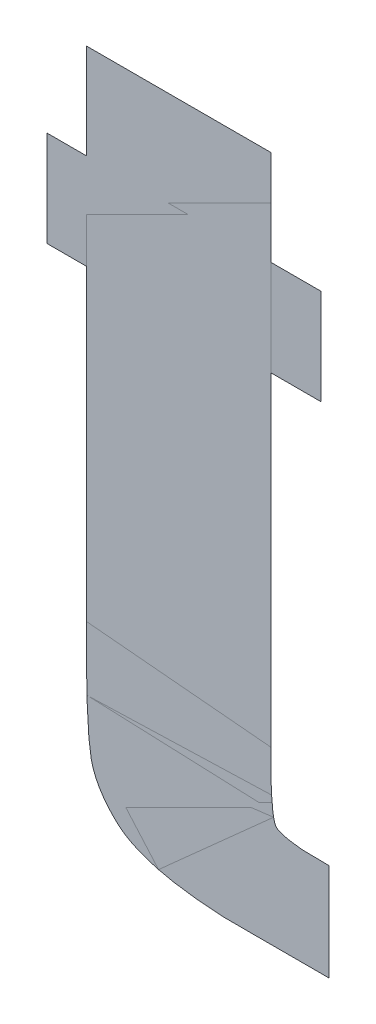
ISO-10303-21;
HEADER;
FILE_DESCRIPTION(('STEP AP214'),'2;1');
FILE_NAME('part.step','',(''),(''),'','','');
FILE_SCHEMA(('AUTOMOTIVE_DESIGN { 1 0 10303 214 1 1 1 1 }'));
ENDSEC;
DATA;
#1=APPLICATION_CONTEXT('core data for automotive mechanical design processes');
#2=APPLICATION_PROTOCOL_DEFINITION('international standard','automotive_design',2000,#1);
#3=PRODUCT_CONTEXT('',#1,'mechanical');
#4=PRODUCT('Part','Part','',(#3));
#5=PRODUCT_RELATED_PRODUCT_CATEGORY('part','',(#4));
#6=PRODUCT_DEFINITION_FORMATION('','',#4);
#7=PRODUCT_DEFINITION_CONTEXT('part definition',#1,'design');
#8=PRODUCT_DEFINITION('design','',#6,#7);
#9=PRODUCT_DEFINITION_SHAPE('','',#8);
#10=(LENGTH_UNIT() NAMED_UNIT(*) SI_UNIT(.MILLI.,.METRE.));
#11=(NAMED_UNIT(*) PLANE_ANGLE_UNIT() SI_UNIT($,.RADIAN.));
#12=(NAMED_UNIT(*) SI_UNIT($,.STERADIAN.) SOLID_ANGLE_UNIT());
#13=UNCERTAINTY_MEASURE_WITH_UNIT(LENGTH_MEASURE(1.E-05),#10,'distance_accuracy_value','');
#14=(GEOMETRIC_REPRESENTATION_CONTEXT(3) GLOBAL_UNCERTAINTY_ASSIGNED_CONTEXT((#13)) GLOBAL_UNIT_ASSIGNED_CONTEXT((#10,
#11,#12)) REPRESENTATION_CONTEXT('',''));
#15=CARTESIAN_POINT('',(0.,0.,0.));
#16=DIRECTION('',(0.,0.,1.));
#17=DIRECTION('',(1.,0.,0.));
#18=AXIS2_PLACEMENT_3D('',#15,#16,#17);
#19=CARTESIAN_POINT('',(6.196226826953,0.801967895412,0.001668));
#20=DIRECTION('',(0.,0.,1.));
#21=DIRECTION('',(1.,0.,0.));
#22=AXIS2_PLACEMENT_3D('',#19,#20,#21);
#23=PLANE('',#22);
#24=CARTESIAN_POINT('',(6.23493270751,0.840089908038,0.001668));
#25=DIRECTION('',(0.,1.,0.));
#26=VECTOR('',#25,1.);
#27=LINE('',#24,#26);
#28=CARTESIAN_POINT('',(6.23493270751,0.840089908038,0.0015));
#29=VERTEX_POINT('',#28);
#30=CARTESIAN_POINT('',(6.23493270751,0.869123819549,0.0015));
#31=VERTEX_POINT('',#30);
#32=EDGE_CURVE('E215',#29,#31,#27,.T.);
#33=ORIENTED_EDGE('',*,*,#32,.T.);
#34=CARTESIAN_POINT('',(6.23493270751,0.869123819549,0.001668));
#35=DIRECTION('',(-1.,0.,0.));
#36=VECTOR('',#35,1.);
#37=LINE('',#34,#36);
#38=CARTESIAN_POINT('',(6.219740544511,0.869123819549,0.0015));
#39=VERTEX_POINT('',#38);
#40=EDGE_CURVE('E28',#31,#39,#37,.T.);
#41=ORIENTED_EDGE('',*,*,#40,.T.);
#42=CARTESIAN_POINT('',(6.219740544511,0.869123819549,0.001668));
#43=DIRECTION('',(0.,1.,0.));
#44=VECTOR('',#43,1.);
#45=LINE('',#42,#44);
#46=CARTESIAN_POINT('',(6.219740544511,0.897988929248,0.0015));
#47=VERTEX_POINT('',#46);
#48=EDGE_CURVE('E11',#39,#47,#45,.T.);
#49=ORIENTED_EDGE('',*,*,#48,.T.);
#50=CARTESIAN_POINT('',(6.219740544511,0.897988929248,0.001668));
#51=DIRECTION('',(-1.,0.,0.));
#52=VECTOR('',#51,1.);
#53=LINE('',#50,#52);
#54=CARTESIAN_POINT('',(6.163698343224,0.897988929248,0.0015));
#55=VERTEX_POINT('',#54);
#56=EDGE_CURVE('E77',#47,#55,#53,.T.);
#57=ORIENTED_EDGE('',*,*,#56,.T.);
#58=CARTESIAN_POINT('',(6.163698343224,0.897988929248,0.001668));
#59=DIRECTION('',(0.,-1.,0.));
#60=VECTOR('',#59,1.);
#61=LINE('',#58,#60);
#62=CARTESIAN_POINT('',(6.163698343224,0.869123819549,0.0015));
#63=VERTEX_POINT('',#62);
#64=EDGE_CURVE('E74',#55,#63,#61,.T.);
#65=ORIENTED_EDGE('',*,*,#64,.T.);
#66=CARTESIAN_POINT('',(6.163698343224,0.869123819549,0.001668));
#67=DIRECTION('',(-1.,0.,0.));
#68=VECTOR('',#67,1.);
#69=LINE('',#66,#68);
#70=CARTESIAN_POINT('',(6.151713414635,0.869123819549,0.0015));
#71=VERTEX_POINT('',#70);
#72=EDGE_CURVE('E196',#63,#71,#69,.T.);
#73=ORIENTED_EDGE('',*,*,#72,.T.);
#74=CARTESIAN_POINT('',(6.151713414635,0.869123819549,0.001668));
#75=DIRECTION('',(0.,-1.,0.));
#76=VECTOR('',#75,1.);
#77=LINE('',#74,#76);
#78=CARTESIAN_POINT('',(6.151713414635,0.840089908038,0.0015));
#79=VERTEX_POINT('',#78);
#80=EDGE_CURVE('E197',#71,#79,#77,.T.);
#81=ORIENTED_EDGE('',*,*,#80,.T.);
#82=CARTESIAN_POINT('',(6.151713414635,0.840089908038,0.001668));
#83=DIRECTION('',(1.,0.,0.));
#84=VECTOR('',#83,1.);
#85=LINE('',#82,#84);
#86=CARTESIAN_POINT('',(6.163698343224,0.840089908038,0.0015));
#87=VERTEX_POINT('',#86);
#88=EDGE_CURVE('E198',#79,#87,#85,.T.);
#89=ORIENTED_EDGE('',*,*,#88,.T.);
#90=CARTESIAN_POINT('',(6.163698343224,0.840089908038,0.001668));
#91=DIRECTION('',(0.,-1.,0.));
#92=VECTOR('',#91,1.);
#93=LINE('',#90,#92);
#94=CARTESIAN_POINT('',(6.163698343224,0.746742506497,0.0015));
#95=VERTEX_POINT('',#94);
#96=EDGE_CURVE('E200',#87,#95,#93,.T.);
#97=ORIENTED_EDGE('',*,*,#96,.T.);
#98=CARTESIAN_POINT('',(6.163698343224,0.746742506497,0.001668));
#99=CARTESIAN_POINT('',(6.163698343224,0.720283110157466,0.001668));
#100=CARTESIAN_POINT('',(6.165217559524,0.7119693334085,0.001668));
#101=CARTESIAN_POINT('',(6.16649785844449,0.704963010874355,0.001668));
#102=CARTESIAN_POINT('',(6.1729824428345,0.6988027921425,0.001668));
#103=CARTESIAN_POINT('',(6.18240001561195,0.689856296154,0.001668));
#104=CARTESIAN_POINT('',(6.214676490178,0.689856296154,0.001668));
#105=B_SPLINE_CURVE_WITH_KNOTS('',2,(#98,#99,#100,#101,#102,#103,#104),.UNSPECIFIED.,.F.,.F.,(3,
2,2,3),(0.,0.25,0.5,1.),.UNSPECIFIED.);
#106=CARTESIAN_POINT('',(6.214676490178,0.689856296154,0.0015));
#107=VERTEX_POINT('',#106);
#108=EDGE_CURVE('E202',#95,#107,#105,.T.);
#109=ORIENTED_EDGE('',*,*,#108,.T.);
#110=CARTESIAN_POINT('',(6.214676490178,0.689856296154,0.001668));
#111=DIRECTION('',(1.,0.,0.));
#112=VECTOR('',#111,1.);
#113=LINE('',#110,#112);
#114=CARTESIAN_POINT('',(6.237295932866,0.689856296154,0.0015));
#115=VERTEX_POINT('',#114);
#116=EDGE_CURVE('E204',#107,#115,#113,.T.);
#117=ORIENTED_EDGE('',*,*,#116,.T.);
#118=CARTESIAN_POINT('',(6.237295932866,0.689856296154,0.001668));
#119=DIRECTION('',(0.,1.,0.));
#120=VECTOR('',#119,1.);
#121=LINE('',#118,#120);
#122=CARTESIAN_POINT('',(6.237295932866,0.719396613097,0.0015));
#123=VERTEX_POINT('',#122);
#124=EDGE_CURVE('E206',#115,#123,#121,.T.);
#125=ORIENTED_EDGE('',*,*,#124,.T.);
#126=CARTESIAN_POINT('',(6.237295932866,0.719396613097,0.001668));
#127=CARTESIAN_POINT('',(6.22458782101224,0.719396613097,0.001668));
#128=CARTESIAN_POINT('',(6.221597364433,0.721506635736,0.001668));
#129=CARTESIAN_POINT('',(6.219740544511,0.722816780848679,0.001668));
#130=CARTESIAN_POINT('',(6.219740544511,0.741678452163,0.001668));
#131=B_SPLINE_CURVE_WITH_KNOTS('',2,(#126,#127,#128,#129,#130),.UNSPECIFIED.,.F.,.F.,(3,2,3),
(0.,0.5,1.),.UNSPECIFIED.);
#132=CARTESIAN_POINT('',(6.219740544511,0.741678452163,0.0015));
#133=VERTEX_POINT('',#132);
#134=EDGE_CURVE('E208',#123,#133,#131,.T.);
#135=ORIENTED_EDGE('',*,*,#134,.T.);
#136=CARTESIAN_POINT('',(6.219740544511,0.741678452163,0.001668));
#137=DIRECTION('',(0.,1.,0.));
#138=VECTOR('',#137,1.);
#139=LINE('',#136,#138);
#140=CARTESIAN_POINT('',(6.219740544511,0.840089908038,0.0015));
#141=VERTEX_POINT('',#140);
#142=EDGE_CURVE('E210',#133,#141,#139,.T.);
#143=ORIENTED_EDGE('',*,*,#142,.T.);
#144=CARTESIAN_POINT('',(6.219740544511,0.840089908038,0.001668));
#145=DIRECTION('',(1.,0.,0.));
#146=VECTOR('',#145,1.);
#147=LINE('',#144,#146);
#148=EDGE_CURVE('E213',#141,#29,#147,.T.);
#149=ORIENTED_EDGE('',*,*,#148,.T.);
#150=EDGE_LOOP('',(#33,#41,#49,#57,#65,#73,#81,#89,#97,#109,#117,#125,#135,#143,#149));
#151=FACE_BOUND('',#150,.T.);
#152=ADVANCED_FACE('F17',(#151),#23,.T.);
#153=CARTESIAN_POINT('',(6.196226826953,0.801967895412,0.001332));
#154=DIRECTION('',(0.,0.,1.));
#155=DIRECTION('',(1.,0.,0.));
#156=AXIS2_PLACEMENT_3D('',#153,#154,#155);
#157=PLANE('',#156);
#158=ORIENTED_EDGE('',*,*,#40,.F.);
#159=ORIENTED_EDGE('',*,*,#32,.F.);
#160=ORIENTED_EDGE('',*,*,#148,.F.);
#161=ORIENTED_EDGE('',*,*,#142,.F.);
#162=ORIENTED_EDGE('',*,*,#134,.F.);
#163=ORIENTED_EDGE('',*,*,#124,.F.);
#164=ORIENTED_EDGE('',*,*,#116,.F.);
#165=ORIENTED_EDGE('',*,*,#108,.F.);
#166=ORIENTED_EDGE('',*,*,#96,.F.);
#167=ORIENTED_EDGE('',*,*,#88,.F.);
#168=ORIENTED_EDGE('',*,*,#80,.F.);
#169=ORIENTED_EDGE('',*,*,#72,.F.);
#170=ORIENTED_EDGE('',*,*,#64,.F.);
#171=ORIENTED_EDGE('',*,*,#56,.F.);
#172=ORIENTED_EDGE('',*,*,#48,.F.);
#173=EDGE_LOOP('',(#158,#159,#160,#161,#162,#163,#164,#165,#166,#167,#168,#169,#170,#171,#172));
#174=FACE_BOUND('',#173,.T.);
#175=ADVANCED_FACE('F79',(#174),#157,.F.);
#176=CLOSED_SHELL('',(#152,#175));
#177=MANIFOLD_SOLID_BREP('B1',#176);
#178=ADVANCED_BREP_SHAPE_REPRESENTATION('',(#18,#177),#14);
#179=SHAPE_DEFINITION_REPRESENTATION(#9,#178);
ENDSEC;
END-ISO-10303-21;
